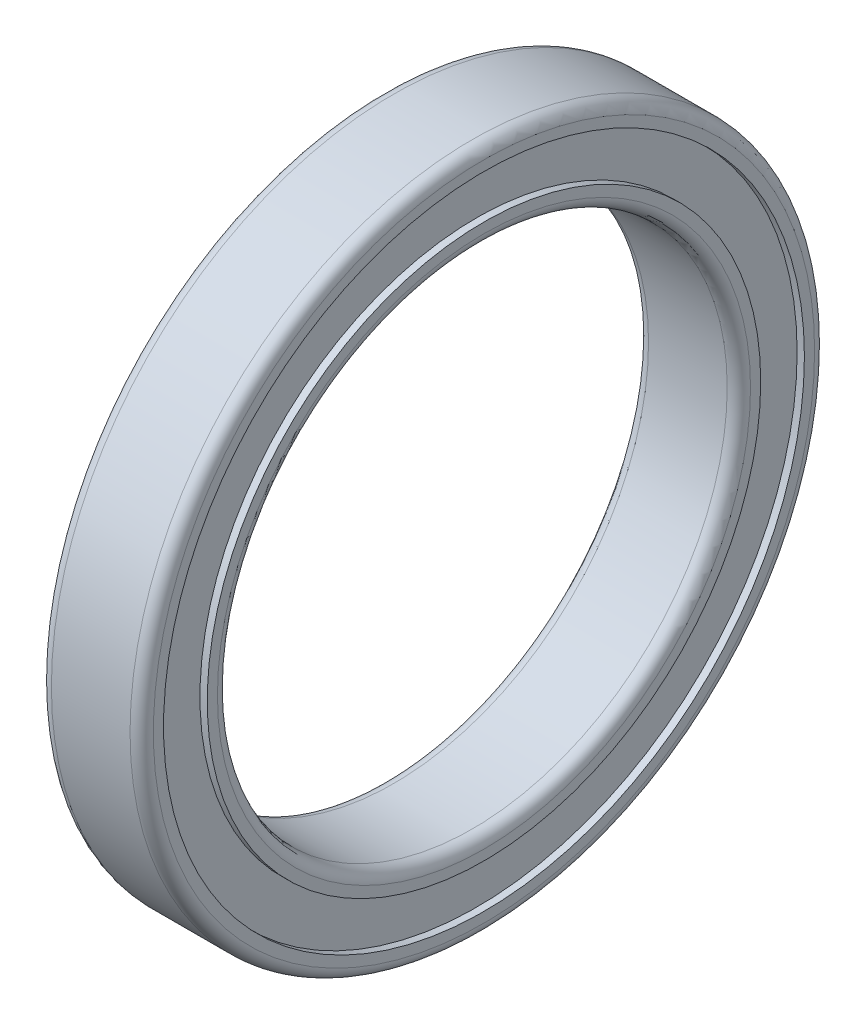
ISO-10303-21;
HEADER;
FILE_DESCRIPTION(('STEP AP214'),'2;1');
FILE_NAME('part.step','',(''),(''),'','','');
FILE_SCHEMA(('AUTOMOTIVE_DESIGN { 1 0 10303 214 1 1 1 1 }'));
ENDSEC;
DATA;
#1=APPLICATION_CONTEXT('core data for automotive mechanical design processes');
#2=APPLICATION_PROTOCOL_DEFINITION('international standard','automotive_design',2000,#1);
#3=PRODUCT_CONTEXT('',#1,'mechanical');
#4=PRODUCT('Part','Part','',(#3));
#5=PRODUCT_RELATED_PRODUCT_CATEGORY('part','',(#4));
#6=PRODUCT_DEFINITION_FORMATION('','',#4);
#7=PRODUCT_DEFINITION_CONTEXT('part definition',#1,'design');
#8=PRODUCT_DEFINITION('design','',#6,#7);
#9=PRODUCT_DEFINITION_SHAPE('','',#8);
#10=(LENGTH_UNIT() NAMED_UNIT(*) SI_UNIT(.MILLI.,.METRE.));
#11=(NAMED_UNIT(*) PLANE_ANGLE_UNIT() SI_UNIT($,.RADIAN.));
#12=(NAMED_UNIT(*) SI_UNIT($,.STERADIAN.) SOLID_ANGLE_UNIT());
#13=UNCERTAINTY_MEASURE_WITH_UNIT(LENGTH_MEASURE(1.E-05),#10,'distance_accuracy_value','');
#14=(GEOMETRIC_REPRESENTATION_CONTEXT(3) GLOBAL_UNCERTAINTY_ASSIGNED_CONTEXT((#13)) GLOBAL_UNIT_ASSIGNED_CONTEXT((#10,
#11,#12)) REPRESENTATION_CONTEXT('',''));
#15=CARTESIAN_POINT('',(0.,0.,0.));
#16=DIRECTION('',(0.,0.,1.));
#17=DIRECTION('',(1.,0.,0.));
#18=AXIS2_PLACEMENT_3D('',#15,#16,#17);
#19=CARTESIAN_POINT('',(-3.5,17.5,0.));
#20=DIRECTION('',(-1.,0.,0.));
#21=DIRECTION('',(0.,0.,1.));
#22=AXIS2_PLACEMENT_3D('',#19,#20,#21);
#23=PLANE('',#22);
#24=CARTESIAN_POINT('',(-3.5,0.,0.));
#25=DIRECTION('',(-1.,0.,0.));
#26=DIRECTION('',(0.,0.,1.));
#27=AXIS2_PLACEMENT_3D('',#24,#25,#26);
#28=CIRCLE('',#27,18.3);
#29=CARTESIAN_POINT('',(-3.5,0.,18.3));
#30=VERTEX_POINT('',#29);
#31=EDGE_CURVE('E51',#30,#30,#28,.F.);
#32=ORIENTED_EDGE('',*,*,#31,.T.);
#33=EDGE_LOOP('',(#32));
#34=FACE_BOUND('',#33,.T.);
#35=CARTESIAN_POINT('',(-3.5,0.,0.));
#36=DIRECTION('',(1.,0.,0.));
#37=DIRECTION('',(0.,0.,-1.));
#38=AXIS2_PLACEMENT_3D('',#35,#36,#37);
#39=CIRCLE('',#38,19.);
#40=CARTESIAN_POINT('',(-3.5,0.,-19.));
#41=VERTEX_POINT('',#40);
#42=EDGE_CURVE('E89',#41,#41,#39,.T.);
#43=ORIENTED_EDGE('',*,*,#42,.F.);
#44=EDGE_LOOP('',(#43));
#45=FACE_BOUND('',#44,.T.);
#46=ADVANCED_FACE('F36',(#34,#45),#23,.T.);
#47=CARTESIAN_POINT('',(0.,0.,0.));
#48=DIRECTION('',(1.,0.,0.));
#49=DIRECTION('',(0.,0.,-1.));
#50=AXIS2_PLACEMENT_3D('',#47,#48,#49);
#51=CYLINDRICAL_SURFACE('',#50,17.5);
#52=CARTESIAN_POINT('',(-2.7,0.,0.));
#53=DIRECTION('',(-1.,0.,0.));
#54=DIRECTION('',(0.,0.,1.));
#55=AXIS2_PLACEMENT_3D('',#52,#53,#54);
#56=CIRCLE('',#55,17.5);
#57=CARTESIAN_POINT('',(-2.7,0.,17.5));
#58=VERTEX_POINT('',#57);
#59=EDGE_CURVE('E43',#58,#58,#56,.T.);
#60=ORIENTED_EDGE('',*,*,#59,.T.);
#61=EDGE_LOOP('',(#60));
#62=FACE_BOUND('',#61,.T.);
#63=CARTESIAN_POINT('',(2.7,0.,0.));
#64=DIRECTION('',(1.,0.,0.));
#65=DIRECTION('',(0.,0.,-1.));
#66=AXIS2_PLACEMENT_3D('',#63,#64,#65);
#67=CIRCLE('',#66,17.5);
#68=CARTESIAN_POINT('',(2.7,0.,-17.5));
#69=VERTEX_POINT('',#68);
#70=EDGE_CURVE('E47',#69,#69,#67,.T.);
#71=ORIENTED_EDGE('',*,*,#70,.T.);
#72=EDGE_LOOP('',(#71));
#73=FACE_BOUND('',#72,.T.);
#74=ADVANCED_FACE('F97',(#62,#73),#51,.F.);
#75=CARTESIAN_POINT('',(3.5,17.5,0.));
#76=DIRECTION('',(1.,0.,0.));
#77=DIRECTION('',(0.,0.,-1.));
#78=AXIS2_PLACEMENT_3D('',#75,#76,#77);
#79=PLANE('',#78);
#80=CARTESIAN_POINT('',(3.5,0.,0.));
#81=DIRECTION('',(1.,0.,0.));
#82=DIRECTION('',(0.,0.,-1.));
#83=AXIS2_PLACEMENT_3D('',#80,#81,#82);
#84=CIRCLE('',#83,18.3);
#85=CARTESIAN_POINT('',(3.5,0.,-18.3));
#86=VERTEX_POINT('',#85);
#87=EDGE_CURVE('E10',#86,#86,#84,.F.);
#88=ORIENTED_EDGE('',*,*,#87,.T.);
#89=EDGE_LOOP('',(#88));
#90=FACE_BOUND('',#89,.T.);
#91=CARTESIAN_POINT('',(3.5,0.,0.));
#92=DIRECTION('',(1.,0.,0.));
#93=DIRECTION('',(0.,0.,-1.));
#94=AXIS2_PLACEMENT_3D('',#91,#92,#93);
#95=CIRCLE('',#94,19.);
#96=CARTESIAN_POINT('',(3.5,0.,-19.));
#97=VERTEX_POINT('',#96);
#98=EDGE_CURVE('E68',#97,#97,#95,.T.);
#99=ORIENTED_EDGE('',*,*,#98,.T.);
#100=EDGE_LOOP('',(#99));
#101=FACE_BOUND('',#100,.T.);
#102=ADVANCED_FACE('F103',(#90,#101),#79,.T.);
#103=CARTESIAN_POINT('',(0.,0.,0.));
#104=DIRECTION('',(1.,0.,0.));
#105=DIRECTION('',(0.,0.,-1.));
#106=AXIS2_PLACEMENT_3D('',#103,#104,#105);
#107=CYLINDRICAL_SURFACE('',#106,19.);
#108=CARTESIAN_POINT('',(3.,0.,0.));
#109=DIRECTION('',(1.,0.,0.));
#110=DIRECTION('',(0.,0.,-1.));
#111=AXIS2_PLACEMENT_3D('',#108,#109,#110);
#112=CIRCLE('',#111,19.);
#113=CARTESIAN_POINT('',(3.,0.,-19.));
#114=VERTEX_POINT('',#113);
#115=EDGE_CURVE('E71',#114,#114,#112,.T.);
#116=ORIENTED_EDGE('',*,*,#115,.T.);
#117=EDGE_LOOP('',(#116));
#118=FACE_BOUND('',#117,.T.);
#119=ORIENTED_EDGE('',*,*,#98,.F.);
#120=EDGE_LOOP('',(#119));
#121=FACE_BOUND('',#120,.T.);
#122=ADVANCED_FACE('F191',(#118,#121),#107,.T.);
#123=CARTESIAN_POINT('',(3.,19.,0.));
#124=DIRECTION('',(1.,0.,0.));
#125=DIRECTION('',(0.,0.,-1.));
#126=AXIS2_PLACEMENT_3D('',#123,#124,#125);
#127=PLANE('',#126);
#128=CARTESIAN_POINT('',(3.,0.,0.));
#129=DIRECTION('',(1.,0.,0.));
#130=DIRECTION('',(0.,0.,-1.));
#131=AXIS2_PLACEMENT_3D('',#128,#129,#130);
#132=CIRCLE('',#131,22.);
#133=CARTESIAN_POINT('',(3.,0.,-22.));
#134=VERTEX_POINT('',#133);
#135=EDGE_CURVE('E74',#134,#134,#132,.T.);
#136=ORIENTED_EDGE('',*,*,#135,.T.);
#137=EDGE_LOOP('',(#136));
#138=FACE_BOUND('',#137,.T.);
#139=ORIENTED_EDGE('',*,*,#115,.F.);
#140=EDGE_LOOP('',(#139));
#141=FACE_BOUND('',#140,.T.);
#142=ADVANCED_FACE('F234',(#138,#141),#127,.T.);
#143=CARTESIAN_POINT('',(0.,0.,0.));
#144=DIRECTION('',(1.,0.,0.));
#145=DIRECTION('',(0.,0.,-1.));
#146=AXIS2_PLACEMENT_3D('',#143,#144,#145);
#147=CYLINDRICAL_SURFACE('',#146,22.);
#148=CARTESIAN_POINT('',(3.5,0.,0.));
#149=DIRECTION('',(1.,0.,0.));
#150=DIRECTION('',(0.,0.,-1.));
#151=AXIS2_PLACEMENT_3D('',#148,#149,#150);
#152=CIRCLE('',#151,22.);
#153=CARTESIAN_POINT('',(3.5,0.,-22.));
#154=VERTEX_POINT('',#153);
#155=EDGE_CURVE('E77',#154,#154,#152,.T.);
#156=ORIENTED_EDGE('',*,*,#155,.T.);
#157=EDGE_LOOP('',(#156));
#158=FACE_BOUND('',#157,.T.);
#159=ORIENTED_EDGE('',*,*,#135,.F.);
#160=EDGE_LOOP('',(#159));
#161=FACE_BOUND('',#160,.T.);
#162=ADVANCED_FACE('F179',(#158,#161),#147,.F.);
#163=CARTESIAN_POINT('',(3.5,22.,0.));
#164=DIRECTION('',(1.,0.,0.));
#165=DIRECTION('',(0.,0.,-1.));
#166=AXIS2_PLACEMENT_3D('',#163,#164,#165);
#167=PLANE('',#166);
#168=CARTESIAN_POINT('',(3.5,0.,0.));
#169=DIRECTION('',(1.,0.,0.));
#170=DIRECTION('',(0.,0.,-1.));
#171=AXIS2_PLACEMENT_3D('',#168,#169,#170);
#172=CIRCLE('',#171,22.7);
#173=CARTESIAN_POINT('',(3.5,0.,-22.7));
#174=VERTEX_POINT('',#173);
#175=EDGE_CURVE('E65',#174,#174,#172,.T.);
#176=ORIENTED_EDGE('',*,*,#175,.T.);
#177=EDGE_LOOP('',(#176));
#178=FACE_BOUND('',#177,.T.);
#179=ORIENTED_EDGE('',*,*,#155,.F.);
#180=EDGE_LOOP('',(#179));
#181=FACE_BOUND('',#180,.T.);
#182=ADVANCED_FACE('F169',(#178,#181),#167,.T.);
#183=CARTESIAN_POINT('',(0.,0.,0.));
#184=DIRECTION('',(1.,0.,0.));
#185=DIRECTION('',(0.,0.,-1.));
#186=AXIS2_PLACEMENT_3D('',#183,#184,#185);
#187=CYLINDRICAL_SURFACE('',#186,23.5);
#188=CARTESIAN_POINT('',(2.7,0.,0.));
#189=DIRECTION('',(1.,0.,0.));
#190=DIRECTION('',(0.,0.,-1.));
#191=AXIS2_PLACEMENT_3D('',#188,#189,#190);
#192=CIRCLE('',#191,23.5);
#193=CARTESIAN_POINT('',(2.7,0.,-23.5));
#194=VERTEX_POINT('',#193);
#195=EDGE_CURVE('E59',#194,#194,#192,.F.);
#196=ORIENTED_EDGE('',*,*,#195,.T.);
#197=EDGE_LOOP('',(#196));
#198=FACE_BOUND('',#197,.T.);
#199=CARTESIAN_POINT('',(-2.7,0.,0.));
#200=DIRECTION('',(-1.,0.,0.));
#201=DIRECTION('',(0.,0.,1.));
#202=AXIS2_PLACEMENT_3D('',#199,#200,#201);
#203=CIRCLE('',#202,23.5);
#204=CARTESIAN_POINT('',(-2.7,0.,23.5));
#205=VERTEX_POINT('',#204);
#206=EDGE_CURVE('E62',#205,#205,#203,.F.);
#207=ORIENTED_EDGE('',*,*,#206,.T.);
#208=EDGE_LOOP('',(#207));
#209=FACE_BOUND('',#208,.T.);
#210=ADVANCED_FACE('F157',(#198,#209),#187,.T.);
#211=CARTESIAN_POINT('',(-3.5,22.,0.));
#212=DIRECTION('',(-1.,0.,0.));
#213=DIRECTION('',(0.,0.,1.));
#214=AXIS2_PLACEMENT_3D('',#211,#212,#213);
#215=PLANE('',#214);
#216=CARTESIAN_POINT('',(-3.5,0.,0.));
#217=DIRECTION('',(-1.,0.,0.));
#218=DIRECTION('',(0.,0.,1.));
#219=AXIS2_PLACEMENT_3D('',#216,#217,#218);
#220=CIRCLE('',#219,22.7);
#221=CARTESIAN_POINT('',(-3.5,0.,22.7));
#222=VERTEX_POINT('',#221);
#223=EDGE_CURVE('E56',#222,#222,#220,.T.);
#224=ORIENTED_EDGE('',*,*,#223,.T.);
#225=EDGE_LOOP('',(#224));
#226=FACE_BOUND('',#225,.T.);
#227=CARTESIAN_POINT('',(-3.5,0.,0.));
#228=DIRECTION('',(1.,0.,0.));
#229=DIRECTION('',(0.,0.,-1.));
#230=AXIS2_PLACEMENT_3D('',#227,#228,#229);
#231=CIRCLE('',#230,22.);
#232=CARTESIAN_POINT('',(-3.5,0.,-22.));
#233=VERTEX_POINT('',#232);
#234=EDGE_CURVE('E80',#233,#233,#231,.T.);
#235=ORIENTED_EDGE('',*,*,#234,.T.);
#236=EDGE_LOOP('',(#235));
#237=FACE_BOUND('',#236,.T.);
#238=ADVANCED_FACE('F151',(#226,#237),#215,.T.);
#239=CARTESIAN_POINT('',(0.,0.,0.));
#240=DIRECTION('',(1.,0.,0.));
#241=DIRECTION('',(0.,0.,-1.));
#242=AXIS2_PLACEMENT_3D('',#239,#240,#241);
#243=CYLINDRICAL_SURFACE('',#242,22.);
#244=CARTESIAN_POINT('',(-3.,0.,0.));
#245=DIRECTION('',(1.,0.,0.));
#246=DIRECTION('',(0.,0.,-1.));
#247=AXIS2_PLACEMENT_3D('',#244,#245,#246);
#248=CIRCLE('',#247,22.);
#249=CARTESIAN_POINT('',(-3.,0.,-22.));
#250=VERTEX_POINT('',#249);
#251=EDGE_CURVE('E83',#250,#250,#248,.T.);
#252=ORIENTED_EDGE('',*,*,#251,.T.);
#253=EDGE_LOOP('',(#252));
#254=FACE_BOUND('',#253,.T.);
#255=ORIENTED_EDGE('',*,*,#234,.F.);
#256=EDGE_LOOP('',(#255));
#257=FACE_BOUND('',#256,.T.);
#258=ADVANCED_FACE('F156',(#254,#257),#243,.F.);
#259=CARTESIAN_POINT('',(-3.,19.,0.));
#260=DIRECTION('',(-1.,0.,0.));
#261=DIRECTION('',(0.,0.,1.));
#262=AXIS2_PLACEMENT_3D('',#259,#260,#261);
#263=PLANE('',#262);
#264=CARTESIAN_POINT('',(-3.,0.,0.));
#265=DIRECTION('',(1.,0.,0.));
#266=DIRECTION('',(0.,0.,-1.));
#267=AXIS2_PLACEMENT_3D('',#264,#265,#266);
#268=CIRCLE('',#267,19.);
#269=CARTESIAN_POINT('',(-3.,0.,-19.));
#270=VERTEX_POINT('',#269);
#271=EDGE_CURVE('E86',#270,#270,#268,.T.);
#272=ORIENTED_EDGE('',*,*,#271,.T.);
#273=EDGE_LOOP('',(#272));
#274=FACE_BOUND('',#273,.T.);
#275=ORIENTED_EDGE('',*,*,#251,.F.);
#276=EDGE_LOOP('',(#275));
#277=FACE_BOUND('',#276,.T.);
#278=ADVANCED_FACE('F209',(#274,#277),#263,.T.);
#279=CARTESIAN_POINT('',(0.,0.,0.));
#280=DIRECTION('',(1.,0.,0.));
#281=DIRECTION('',(0.,0.,-1.));
#282=AXIS2_PLACEMENT_3D('',#279,#280,#281);
#283=CYLINDRICAL_SURFACE('',#282,19.);
#284=ORIENTED_EDGE('',*,*,#42,.T.);
#285=EDGE_LOOP('',(#284));
#286=FACE_BOUND('',#285,.T.);
#287=ORIENTED_EDGE('',*,*,#271,.F.);
#288=EDGE_LOOP('',(#287));
#289=FACE_BOUND('',#288,.T.);
#290=ADVANCED_FACE('F93',(#286,#289),#283,.T.);
#291=CARTESIAN_POINT('',(2.7,0.,0.));
#292=DIRECTION('',(1.,0.,0.));
#293=DIRECTION('',(0.,0.,-1.));
#294=AXIS2_PLACEMENT_3D('',#291,#292,#293);
#295=TOROIDAL_SURFACE('',#294,22.7,0.8);
#296=ORIENTED_EDGE('',*,*,#195,.F.);
#297=EDGE_LOOP('',(#296));
#298=FACE_BOUND('',#297,.T.);
#299=ORIENTED_EDGE('',*,*,#175,.F.);
#300=EDGE_LOOP('',(#299));
#301=FACE_BOUND('',#300,.T.);
#302=ADVANCED_FACE('F107',(#298,#301),#295,.T.);
#303=CARTESIAN_POINT('',(-2.7,0.,0.));
#304=DIRECTION('',(-1.,0.,0.));
#305=DIRECTION('',(0.,0.,1.));
#306=AXIS2_PLACEMENT_3D('',#303,#304,#305);
#307=TOROIDAL_SURFACE('',#306,22.7,0.8);
#308=ORIENTED_EDGE('',*,*,#223,.F.);
#309=EDGE_LOOP('',(#308));
#310=FACE_BOUND('',#309,.T.);
#311=ORIENTED_EDGE('',*,*,#206,.F.);
#312=EDGE_LOOP('',(#311));
#313=FACE_BOUND('',#312,.T.);
#314=ADVANCED_FACE('F110',(#310,#313),#307,.T.);
#315=CARTESIAN_POINT('',(-2.7,0.,0.));
#316=DIRECTION('',(-1.,0.,0.));
#317=DIRECTION('',(0.,0.,1.));
#318=AXIS2_PLACEMENT_3D('',#315,#316,#317);
#319=TOROIDAL_SURFACE('',#318,18.3,0.8);
#320=ORIENTED_EDGE('',*,*,#59,.F.);
#321=EDGE_LOOP('',(#320));
#322=FACE_BOUND('',#321,.T.);
#323=ORIENTED_EDGE('',*,*,#31,.F.);
#324=EDGE_LOOP('',(#323));
#325=FACE_BOUND('',#324,.T.);
#326=ADVANCED_FACE('F113',(#322,#325),#319,.T.);
#327=CARTESIAN_POINT('',(2.7,0.,0.));
#328=DIRECTION('',(1.,0.,0.));
#329=DIRECTION('',(0.,0.,-1.));
#330=AXIS2_PLACEMENT_3D('',#327,#328,#329);
#331=TOROIDAL_SURFACE('',#330,18.3,0.8);
#332=ORIENTED_EDGE('',*,*,#87,.F.);
#333=EDGE_LOOP('',(#332));
#334=FACE_BOUND('',#333,.T.);
#335=ORIENTED_EDGE('',*,*,#70,.F.);
#336=EDGE_LOOP('',(#335));
#337=FACE_BOUND('',#336,.T.);
#338=ADVANCED_FACE('F38',(#334,#337),#331,.T.);
#339=CLOSED_SHELL('',(#46,#74,#102,#122,#142,#162,#182,#210,#238,#258,#278,#290,#302,#314,#326,#338));
#340=MANIFOLD_SOLID_BREP('B2',#339);
#341=ADVANCED_BREP_SHAPE_REPRESENTATION('',(#18,#340),#14);
#342=SHAPE_DEFINITION_REPRESENTATION(#9,#341);
ENDSEC;
END-ISO-10303-21;
